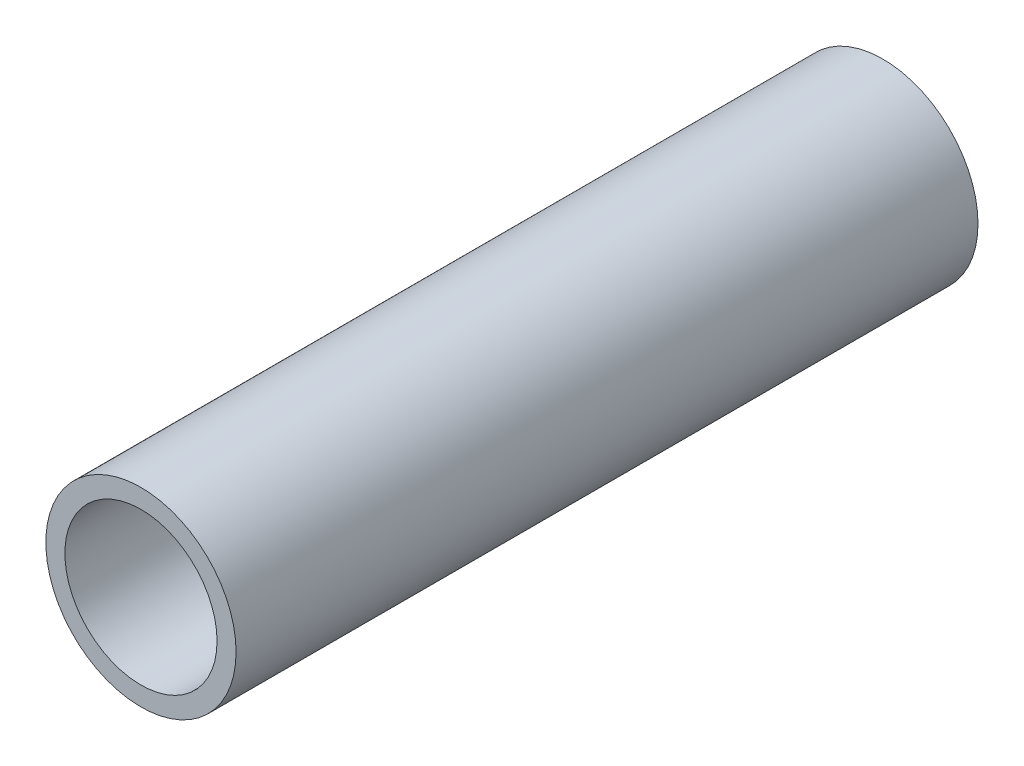
ISO-10303-21;
HEADER;
FILE_DESCRIPTION(('STEP AP214'),'2;1');
FILE_NAME('part.step','',(''),(''),'','','');
FILE_SCHEMA(('AUTOMOTIVE_DESIGN { 1 0 10303 214 1 1 1 1 }'));
ENDSEC;
DATA;
#1=APPLICATION_CONTEXT('core data for automotive mechanical design processes');
#2=APPLICATION_PROTOCOL_DEFINITION('international standard','automotive_design',2000,#1);
#3=PRODUCT_CONTEXT('',#1,'mechanical');
#4=PRODUCT('Part','Part','',(#3));
#5=PRODUCT_RELATED_PRODUCT_CATEGORY('part','',(#4));
#6=PRODUCT_DEFINITION_FORMATION('','',#4);
#7=PRODUCT_DEFINITION_CONTEXT('part definition',#1,'design');
#8=PRODUCT_DEFINITION('design','',#6,#7);
#9=PRODUCT_DEFINITION_SHAPE('','',#8);
#10=(LENGTH_UNIT() NAMED_UNIT(*) SI_UNIT(.MILLI.,.METRE.));
#11=(NAMED_UNIT(*) PLANE_ANGLE_UNIT() SI_UNIT($,.RADIAN.));
#12=(NAMED_UNIT(*) SI_UNIT($,.STERADIAN.) SOLID_ANGLE_UNIT());
#13=UNCERTAINTY_MEASURE_WITH_UNIT(LENGTH_MEASURE(1.E-05),#10,'distance_accuracy_value','');
#14=(GEOMETRIC_REPRESENTATION_CONTEXT(3) GLOBAL_UNCERTAINTY_ASSIGNED_CONTEXT((#13)) GLOBAL_UNIT_ASSIGNED_CONTEXT((#10,
#11,#12)) REPRESENTATION_CONTEXT('',''));
#15=CARTESIAN_POINT('',(0.,0.,0.));
#16=DIRECTION('',(0.,0.,1.));
#17=DIRECTION('',(1.,0.,0.));
#18=AXIS2_PLACEMENT_3D('',#15,#16,#17);
#19=CARTESIAN_POINT('',(0.,0.,39.));
#20=DIRECTION('',(0.,0.,1.));
#21=DIRECTION('',(1.,0.,0.));
#22=AXIS2_PLACEMENT_3D('',#19,#20,#21);
#23=PLANE('',#22);
#24=CARTESIAN_POINT('',(0.,0.,39.));
#25=DIRECTION('',(0.,0.,1.));
#26=DIRECTION('',(1.,0.,0.));
#27=AXIS2_PLACEMENT_3D('',#24,#25,#26);
#28=CIRCLE('',#27,10.);
#29=CARTESIAN_POINT('',(10.,0.,39.));
#30=VERTEX_POINT('',#29);
#31=EDGE_CURVE('E10',#30,#30,#28,.T.);
#32=ORIENTED_EDGE('',*,*,#31,.T.);
#33=EDGE_LOOP('',(#32));
#34=FACE_BOUND('',#33,.T.);
#35=CARTESIAN_POINT('',(0.,0.,39.));
#36=DIRECTION('',(0.,0.,1.));
#37=DIRECTION('',(1.,0.,0.));
#38=AXIS2_PLACEMENT_3D('',#35,#36,#37);
#39=CIRCLE('',#38,8.);
#40=CARTESIAN_POINT('',(8.,0.,39.));
#41=VERTEX_POINT('',#40);
#42=EDGE_CURVE('E42',#41,#41,#39,.T.);
#43=ORIENTED_EDGE('',*,*,#42,.F.);
#44=EDGE_LOOP('',(#43));
#45=FACE_BOUND('',#44,.T.);
#46=ADVANCED_FACE('F31',(#34,#45),#23,.T.);
#47=CARTESIAN_POINT('',(0.,0.,-39.));
#48=DIRECTION('',(0.,0.,1.));
#49=DIRECTION('',(1.,0.,0.));
#50=AXIS2_PLACEMENT_3D('',#47,#48,#49);
#51=PLANE('',#50);
#52=CARTESIAN_POINT('',(0.,0.,-39.));
#53=DIRECTION('',(0.,0.,1.));
#54=DIRECTION('',(1.,0.,0.));
#55=AXIS2_PLACEMENT_3D('',#52,#53,#54);
#56=CIRCLE('',#55,10.);
#57=CARTESIAN_POINT('',(10.,0.,-39.));
#58=VERTEX_POINT('',#57);
#59=EDGE_CURVE('E35',#58,#58,#56,.T.);
#60=ORIENTED_EDGE('',*,*,#59,.F.);
#61=EDGE_LOOP('',(#60));
#62=FACE_BOUND('',#61,.T.);
#63=CARTESIAN_POINT('',(0.,0.,-39.));
#64=DIRECTION('',(0.,0.,1.));
#65=DIRECTION('',(1.,0.,0.));
#66=AXIS2_PLACEMENT_3D('',#63,#64,#65);
#67=CIRCLE('',#66,8.);
#68=CARTESIAN_POINT('',(8.,0.,-39.));
#69=VERTEX_POINT('',#68);
#70=EDGE_CURVE('E44',#69,#69,#67,.T.);
#71=ORIENTED_EDGE('',*,*,#70,.T.);
#72=EDGE_LOOP('',(#71));
#73=FACE_BOUND('',#72,.T.);
#74=ADVANCED_FACE('F54',(#62,#73),#51,.F.);
#75=CARTESIAN_POINT('',(0.,0.,39.));
#76=DIRECTION('',(0.,0.,-1.));
#77=DIRECTION('',(-1.,0.,0.));
#78=AXIS2_PLACEMENT_3D('',#75,#76,#77);
#79=CYLINDRICAL_SURFACE('',#78,10.);
#80=ORIENTED_EDGE('',*,*,#31,.F.);
#81=EDGE_LOOP('',(#80));
#82=FACE_BOUND('',#81,.T.);
#83=ORIENTED_EDGE('',*,*,#59,.T.);
#84=EDGE_LOOP('',(#83));
#85=FACE_BOUND('',#84,.T.);
#86=ADVANCED_FACE('F33',(#82,#85),#79,.T.);
#87=CARTESIAN_POINT('',(0.,0.,39.));
#88=DIRECTION('',(0.,0.,-1.));
#89=DIRECTION('',(-1.,0.,0.));
#90=AXIS2_PLACEMENT_3D('',#87,#88,#89);
#91=CYLINDRICAL_SURFACE('',#90,8.);
#92=ORIENTED_EDGE('',*,*,#42,.T.);
#93=EDGE_LOOP('',(#92));
#94=FACE_BOUND('',#93,.T.);
#95=ORIENTED_EDGE('',*,*,#70,.F.);
#96=EDGE_LOOP('',(#95));
#97=FACE_BOUND('',#96,.T.);
#98=ADVANCED_FACE('F50',(#94,#97),#91,.F.);
#99=CLOSED_SHELL('',(#46,#74,#86,#98));
#100=MANIFOLD_SOLID_BREP('B2',#99);
#101=ADVANCED_BREP_SHAPE_REPRESENTATION('',(#18,#100),#14);
#102=SHAPE_DEFINITION_REPRESENTATION(#9,#101);
ENDSEC;
END-ISO-10303-21;
